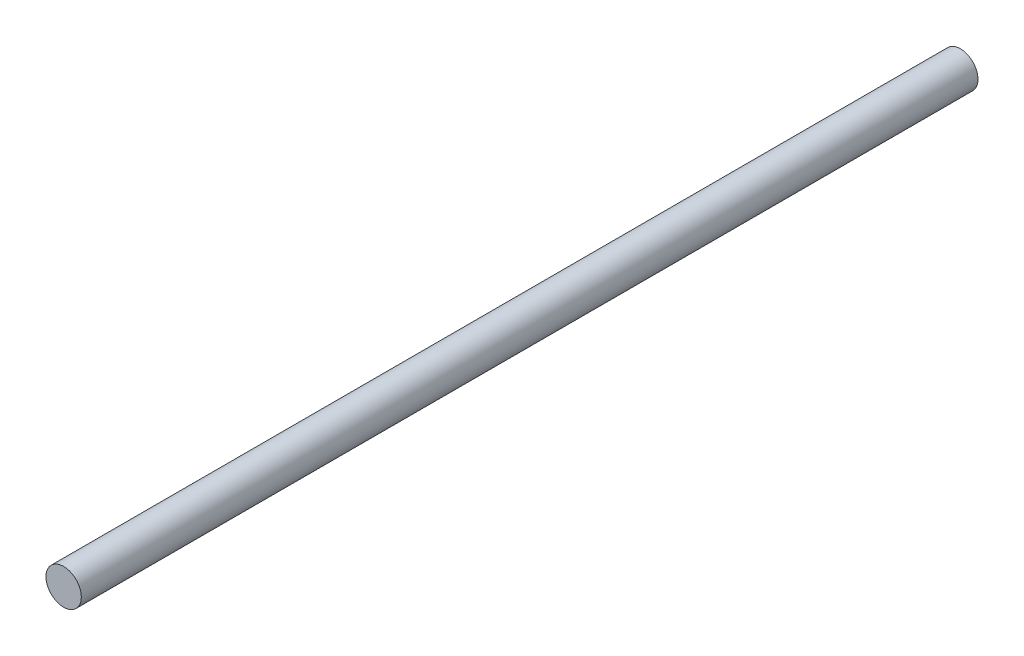
ISO-10303-21;
HEADER;
FILE_DESCRIPTION(('STEP AP214'),'2;1');
FILE_NAME('part.step','',(''),(''),'','','');
FILE_SCHEMA(('AUTOMOTIVE_DESIGN { 1 0 10303 214 1 1 1 1 }'));
ENDSEC;
DATA;
#1=APPLICATION_CONTEXT('core data for automotive mechanical design processes');
#2=APPLICATION_PROTOCOL_DEFINITION('international standard','automotive_design',2000,#1);
#3=PRODUCT_CONTEXT('',#1,'mechanical');
#4=PRODUCT('Part','Part','',(#3));
#5=PRODUCT_RELATED_PRODUCT_CATEGORY('part','',(#4));
#6=PRODUCT_DEFINITION_FORMATION('','',#4);
#7=PRODUCT_DEFINITION_CONTEXT('part definition',#1,'design');
#8=PRODUCT_DEFINITION('design','',#6,#7);
#9=PRODUCT_DEFINITION_SHAPE('','',#8);
#10=(LENGTH_UNIT() NAMED_UNIT(*) SI_UNIT(.MILLI.,.METRE.));
#11=(NAMED_UNIT(*) PLANE_ANGLE_UNIT() SI_UNIT($,.RADIAN.));
#12=(NAMED_UNIT(*) SI_UNIT($,.STERADIAN.) SOLID_ANGLE_UNIT());
#13=UNCERTAINTY_MEASURE_WITH_UNIT(LENGTH_MEASURE(1.E-05),#10,'distance_accuracy_value','');
#14=(GEOMETRIC_REPRESENTATION_CONTEXT(3) GLOBAL_UNCERTAINTY_ASSIGNED_CONTEXT((#13)) GLOBAL_UNIT_ASSIGNED_CONTEXT((#10,
#11,#12)) REPRESENTATION_CONTEXT('',''));
#15=CARTESIAN_POINT('',(0.,0.,0.));
#16=DIRECTION('',(0.,0.,1.));
#17=DIRECTION('',(1.,0.,0.));
#18=AXIS2_PLACEMENT_3D('',#15,#16,#17);
#19=CARTESIAN_POINT('',(0.,0.,101.5));
#20=DIRECTION('',(0.,0.,-1.));
#21=DIRECTION('',(-1.,0.,0.));
#22=AXIS2_PLACEMENT_3D('',#19,#20,#21);
#23=CYLINDRICAL_SURFACE('',#22,4.);
#24=CARTESIAN_POINT('',(0.,0.,101.5));
#25=DIRECTION('',(0.,0.,1.));
#26=DIRECTION('',(1.,0.,0.));
#27=AXIS2_PLACEMENT_3D('',#24,#25,#26);
#28=CIRCLE('',#27,4.);
#29=CARTESIAN_POINT('',(4.,0.,101.5));
#30=VERTEX_POINT('',#29);
#31=EDGE_CURVE('E10',#30,#30,#28,.T.);
#32=ORIENTED_EDGE('',*,*,#31,.F.);
#33=EDGE_LOOP('',(#32));
#34=FACE_BOUND('',#33,.T.);
#35=CARTESIAN_POINT('',(0.,0.,-101.5));
#36=DIRECTION('',(0.,0.,1.));
#37=DIRECTION('',(1.,0.,0.));
#38=AXIS2_PLACEMENT_3D('',#35,#36,#37);
#39=CIRCLE('',#38,4.);
#40=CARTESIAN_POINT('',(4.,0.,-101.5));
#41=VERTEX_POINT('',#40);
#42=EDGE_CURVE('E33',#41,#41,#39,.T.);
#43=ORIENTED_EDGE('',*,*,#42,.T.);
#44=EDGE_LOOP('',(#43));
#45=FACE_BOUND('',#44,.T.);
#46=ADVANCED_FACE('F30',(#34,#45),#23,.T.);
#47=CARTESIAN_POINT('',(0.,0.,101.5));
#48=DIRECTION('',(0.,0.,1.));
#49=DIRECTION('',(1.,0.,0.));
#50=AXIS2_PLACEMENT_3D('',#47,#48,#49);
#51=PLANE('',#50);
#52=ORIENTED_EDGE('',*,*,#31,.T.);
#53=EDGE_LOOP('',(#52));
#54=FACE_BOUND('',#53,.T.);
#55=ADVANCED_FACE('F45',(#54),#51,.T.);
#56=CARTESIAN_POINT('',(0.,0.,-101.5));
#57=DIRECTION('',(0.,0.,1.));
#58=DIRECTION('',(1.,0.,0.));
#59=AXIS2_PLACEMENT_3D('',#56,#57,#58);
#60=PLANE('',#59);
#61=ORIENTED_EDGE('',*,*,#42,.F.);
#62=EDGE_LOOP('',(#61));
#63=FACE_BOUND('',#62,.T.);
#64=ADVANCED_FACE('F43',(#63),#60,.F.);
#65=CLOSED_SHELL('',(#46,#55,#64));
#66=MANIFOLD_SOLID_BREP('B2',#65);
#67=ADVANCED_BREP_SHAPE_REPRESENTATION('',(#18,#66),#14);
#68=SHAPE_DEFINITION_REPRESENTATION(#9,#67);
ENDSEC;
END-ISO-10303-21;
